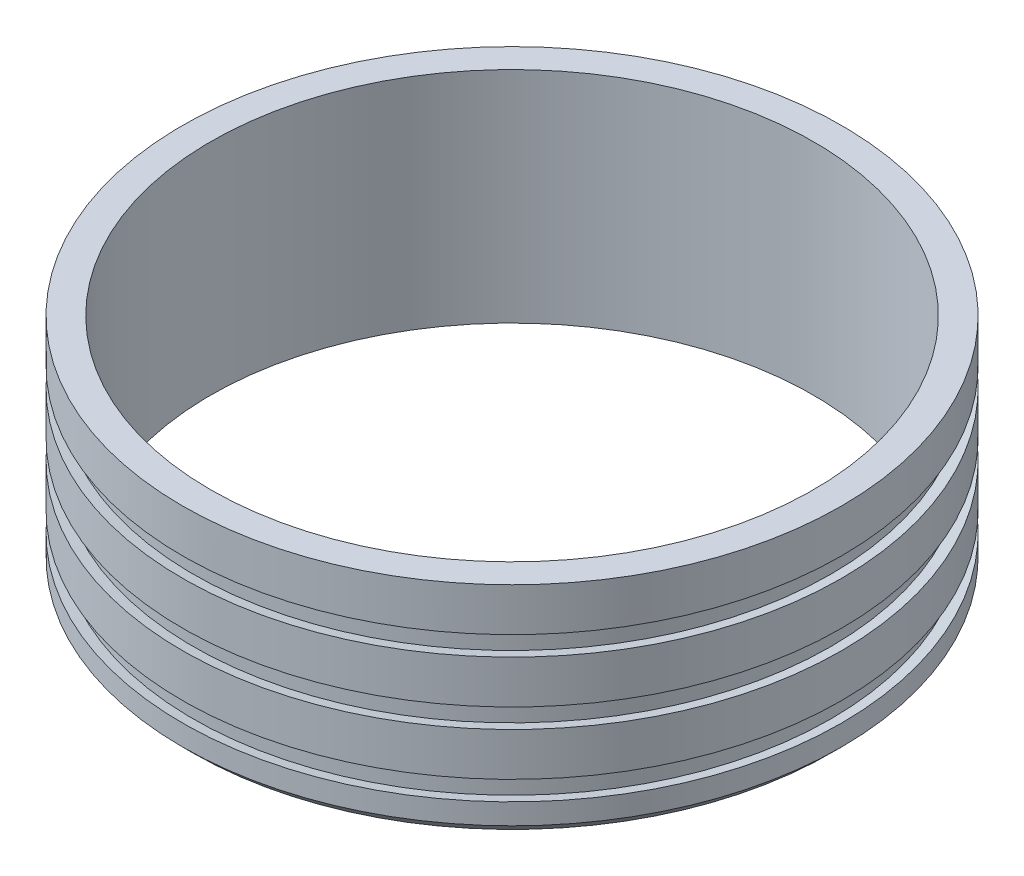
ISO-10303-21;
HEADER;
FILE_DESCRIPTION(('STEP AP214'),'2;1');
FILE_NAME('part.step','',(''),(''),'','','');
FILE_SCHEMA(('AUTOMOTIVE_DESIGN { 1 0 10303 214 1 1 1 1 }'));
ENDSEC;
DATA;
#1=APPLICATION_CONTEXT('core data for automotive mechanical design processes');
#2=APPLICATION_PROTOCOL_DEFINITION('international standard','automotive_design',2000,#1);
#3=PRODUCT_CONTEXT('',#1,'mechanical');
#4=PRODUCT('Part','Part','',(#3));
#5=PRODUCT_RELATED_PRODUCT_CATEGORY('part','',(#4));
#6=PRODUCT_DEFINITION_FORMATION('','',#4);
#7=PRODUCT_DEFINITION_CONTEXT('part definition',#1,'design');
#8=PRODUCT_DEFINITION('design','',#6,#7);
#9=PRODUCT_DEFINITION_SHAPE('','',#8);
#10=(LENGTH_UNIT() NAMED_UNIT(*) SI_UNIT(.MILLI.,.METRE.));
#11=(NAMED_UNIT(*) PLANE_ANGLE_UNIT() SI_UNIT($,.RADIAN.));
#12=(NAMED_UNIT(*) SI_UNIT($,.STERADIAN.) SOLID_ANGLE_UNIT());
#13=UNCERTAINTY_MEASURE_WITH_UNIT(LENGTH_MEASURE(1.E-05),#10,'distance_accuracy_value','');
#14=(GEOMETRIC_REPRESENTATION_CONTEXT(3) GLOBAL_UNCERTAINTY_ASSIGNED_CONTEXT((#13)) GLOBAL_UNIT_ASSIGNED_CONTEXT((#10,
#11,#12)) REPRESENTATION_CONTEXT('',''));
#15=CARTESIAN_POINT('',(0.,0.,0.));
#16=DIRECTION('',(0.,0.,1.));
#17=DIRECTION('',(1.,0.,0.));
#18=AXIS2_PLACEMENT_3D('',#15,#16,#17);
#19=CARTESIAN_POINT('',(0.,50.8,0.));
#20=DIRECTION('',(0.,-1.,0.));
#21=DIRECTION('',(0.,0.,-1.));
#22=AXIS2_PLACEMENT_3D('',#19,#20,#21);
#23=CYLINDRICAL_SURFACE('',#22,76.25);
#24=CARTESIAN_POINT('',(0.,50.8,0.));
#25=DIRECTION('',(0.,1.,0.));
#26=DIRECTION('',(0.,0.,1.));
#27=AXIS2_PLACEMENT_3D('',#24,#25,#26);
#28=CIRCLE('',#27,76.25);
#29=CARTESIAN_POINT('',(0.,50.8,76.25));
#30=VERTEX_POINT('',#29);
#31=EDGE_CURVE('E49',#30,#30,#28,.T.);
#32=ORIENTED_EDGE('',*,*,#31,.F.);
#33=EDGE_LOOP('',(#32));
#34=FACE_BOUND('',#33,.T.);
#35=CARTESIAN_POINT('',(0.,40.8,0.));
#36=DIRECTION('',(0.,-1.,0.));
#37=DIRECTION('',(1.,0.,0.));
#38=AXIS2_PLACEMENT_3D('',#35,#36,#37);
#39=CIRCLE('',#38,76.25);
#40=CARTESIAN_POINT('',(76.25,40.7999999999999,0.));
#41=VERTEX_POINT('',#40);
#42=EDGE_CURVE('E89',#41,#41,#39,.T.);
#43=ORIENTED_EDGE('',*,*,#42,.F.);
#44=EDGE_LOOP('',(#43));
#45=FACE_BOUND('',#44,.T.);
#46=ADVANCED_FACE('F37',(#34,#45),#23,.T.);
#47=CARTESIAN_POINT('',(0.,2.49999999999999,0.));
#48=DIRECTION('',(0.,1.,0.));
#49=DIRECTION('',(0.,0.,1.));
#50=AXIS2_PLACEMENT_3D('',#47,#48,#49);
#51=CIRCLE('',#50,76.25);
#52=CARTESIAN_POINT('',(0.,2.49999999999999,76.25));
#53=VERTEX_POINT('',#52);
#54=EDGE_CURVE('E45',#53,#53,#51,.T.);
#55=ORIENTED_EDGE('',*,*,#54,.T.);
#56=EDGE_LOOP('',(#55));
#57=FACE_BOUND('',#56,.T.);
#58=CARTESIAN_POINT('',(0.,7.29999999999996,0.));
#59=DIRECTION('',(0.,-1.,0.));
#60=DIRECTION('',(1.,0.,0.));
#61=AXIS2_PLACEMENT_3D('',#58,#59,#60);
#62=CIRCLE('',#61,76.2499999999999);
#63=CARTESIAN_POINT('',(76.2499999999999,7.29999999999992,0.));
#64=VERTEX_POINT('',#63);
#65=EDGE_CURVE('E62',#64,#64,#62,.T.);
#66=ORIENTED_EDGE('',*,*,#65,.T.);
#67=EDGE_LOOP('',(#66));
#68=FACE_BOUND('',#67,.T.);
#69=ADVANCED_FACE('F113',(#57,#68),#23,.T.);
#70=CARTESIAN_POINT('',(0.,50.8,0.));
#71=DIRECTION('',(0.,1.,0.));
#72=DIRECTION('',(0.,0.,1.));
#73=AXIS2_PLACEMENT_3D('',#70,#71,#72);
#74=PLANE('',#73);
#75=ORIENTED_EDGE('',*,*,#31,.T.);
#76=EDGE_LOOP('',(#75));
#77=FACE_BOUND('',#76,.T.);
#78=CARTESIAN_POINT('',(0.,50.8,0.));
#79=DIRECTION('',(0.,1.,0.));
#80=DIRECTION('',(0.,0.,1.));
#81=AXIS2_PLACEMENT_3D('',#78,#79,#80);
#82=CIRCLE('',#81,69.75);
#83=CARTESIAN_POINT('',(0.,50.8,69.75));
#84=VERTEX_POINT('',#83);
#85=EDGE_CURVE('E53',#84,#84,#82,.T.);
#86=ORIENTED_EDGE('',*,*,#85,.F.);
#87=EDGE_LOOP('',(#86));
#88=FACE_BOUND('',#87,.T.);
#89=ADVANCED_FACE('F121',(#77,#88),#74,.T.);
#90=CARTESIAN_POINT('',(0.,0.,0.));
#91=DIRECTION('',(0.,1.,0.));
#92=DIRECTION('',(0.,0.,1.));
#93=AXIS2_PLACEMENT_3D('',#90,#91,#92);
#94=PLANE('',#93);
#95=CARTESIAN_POINT('',(0.,0.,0.));
#96=DIRECTION('',(0.,1.,0.));
#97=DIRECTION('',(0.,0.,1.));
#98=AXIS2_PLACEMENT_3D('',#95,#96,#97);
#99=CIRCLE('',#98,73.75);
#100=CARTESIAN_POINT('',(0.,0.,73.75));
#101=VERTEX_POINT('',#100);
#102=EDGE_CURVE('E10',#101,#101,#99,.F.);
#103=ORIENTED_EDGE('',*,*,#102,.T.);
#104=EDGE_LOOP('',(#103));
#105=FACE_BOUND('',#104,.T.);
#106=CARTESIAN_POINT('',(0.,0.,0.));
#107=DIRECTION('',(0.,1.,0.));
#108=DIRECTION('',(0.,0.,1.));
#109=AXIS2_PLACEMENT_3D('',#106,#107,#108);
#110=CIRCLE('',#109,69.75);
#111=CARTESIAN_POINT('',(0.,0.,69.75));
#112=VERTEX_POINT('',#111);
#113=EDGE_CURVE('E56',#112,#112,#110,.T.);
#114=ORIENTED_EDGE('',*,*,#113,.T.);
#115=EDGE_LOOP('',(#114));
#116=FACE_BOUND('',#115,.T.);
#117=ADVANCED_FACE('F164',(#105,#116),#94,.F.);
#118=CARTESIAN_POINT('',(0.,50.8,0.));
#119=DIRECTION('',(0.,-1.,0.));
#120=DIRECTION('',(0.,0.,-1.));
#121=AXIS2_PLACEMENT_3D('',#118,#119,#120);
#122=CYLINDRICAL_SURFACE('',#121,69.75);
#123=ORIENTED_EDGE('',*,*,#85,.T.);
#124=EDGE_LOOP('',(#123));
#125=FACE_BOUND('',#124,.T.);
#126=ORIENTED_EDGE('',*,*,#113,.F.);
#127=EDGE_LOOP('',(#126));
#128=FACE_BOUND('',#127,.T.);
#129=ADVANCED_FACE('F160',(#125,#128),#122,.F.);
#130=CARTESIAN_POINT('',(0.,7.29999999999996,0.));
#131=DIRECTION('',(0.,1.,0.));
#132=DIRECTION('',(-1.,0.,0.));
#133=AXIS2_PLACEMENT_3D('',#130,#131,#132);
#134=CONICAL_SURFACE('',#133,76.2499999999999,1.39626340159546);
#135=CARTESIAN_POINT('',(0.,6.8591825482288,0.));
#136=DIRECTION('',(0.,-1.,0.));
#137=DIRECTION('',(1.,0.,0.));
#138=AXIS2_PLACEMENT_3D('',#135,#136,#137);
#139=CIRCLE('',#138,73.75);
#140=CARTESIAN_POINT('',(73.7499999999999,6.85918254822876,0.));
#141=VERTEX_POINT('',#140);
#142=EDGE_CURVE('E72',#141,#141,#139,.T.);
#143=ORIENTED_EDGE('',*,*,#142,.T.);
#144=EDGE_LOOP('',(#143));
#145=FACE_BOUND('',#144,.T.);
#146=ORIENTED_EDGE('',*,*,#65,.F.);
#147=EDGE_LOOP('',(#146));
#148=FACE_BOUND('',#147,.T.);
#149=ADVANCED_FACE('F156',(#145,#148),#134,.F.);
#150=CARTESIAN_POINT('',(0.,12.2408174517711,0.));
#151=DIRECTION('',(0.,-1.,0.));
#152=DIRECTION('',(1.,0.,0.));
#153=AXIS2_PLACEMENT_3D('',#150,#151,#152);
#154=CONICAL_SURFACE('',#153,73.75,1.39626340159546);
#155=CARTESIAN_POINT('',(0.,11.8,0.));
#156=DIRECTION('',(0.,-1.,0.));
#157=DIRECTION('',(1.,0.,0.));
#158=AXIS2_PLACEMENT_3D('',#155,#156,#157);
#159=CIRCLE('',#158,76.2499999999999);
#160=CARTESIAN_POINT('',(76.2499999999999,11.7999999999999,0.));
#161=VERTEX_POINT('',#160);
#162=EDGE_CURVE('E66',#161,#161,#159,.T.);
#163=ORIENTED_EDGE('',*,*,#162,.T.);
#164=EDGE_LOOP('',(#163));
#165=FACE_BOUND('',#164,.T.);
#166=CARTESIAN_POINT('',(0.,12.2408174517711,0.));
#167=DIRECTION('',(0.,-1.,0.));
#168=DIRECTION('',(1.,0.,0.));
#169=AXIS2_PLACEMENT_3D('',#166,#167,#168);
#170=CIRCLE('',#169,73.75);
#171=CARTESIAN_POINT('',(73.7499999999999,12.2408174517711,0.));
#172=VERTEX_POINT('',#171);
#173=EDGE_CURVE('E69',#172,#172,#170,.T.);
#174=ORIENTED_EDGE('',*,*,#173,.F.);
#175=EDGE_LOOP('',(#174));
#176=FACE_BOUND('',#175,.T.);
#177=ADVANCED_FACE('F143',(#165,#176),#154,.F.);
#178=CARTESIAN_POINT('',(0.,0.,0.));
#179=DIRECTION('',(0.,-1.,0.));
#180=DIRECTION('',(1.,0.,0.));
#181=AXIS2_PLACEMENT_3D('',#178,#179,#180);
#182=CYLINDRICAL_SURFACE('',#181,73.75);
#183=ORIENTED_EDGE('',*,*,#173,.T.);
#184=EDGE_LOOP('',(#183));
#185=FACE_BOUND('',#184,.T.);
#186=ORIENTED_EDGE('',*,*,#142,.F.);
#187=EDGE_LOOP('',(#186));
#188=FACE_BOUND('',#187,.T.);
#189=ADVANCED_FACE('F138',(#185,#188),#182,.T.);
#190=CARTESIAN_POINT('',(0.,36.3,0.));
#191=DIRECTION('',(0.,1.,0.));
#192=DIRECTION('',(-1.,0.,0.));
#193=AXIS2_PLACEMENT_3D('',#190,#191,#192);
#194=CONICAL_SURFACE('',#193,76.25,1.39626340159546);
#195=CARTESIAN_POINT('',(0.,35.8591825482288,0.));
#196=DIRECTION('',(0.,-1.,0.));
#197=DIRECTION('',(1.,0.,0.));
#198=AXIS2_PLACEMENT_3D('',#195,#196,#197);
#199=CIRCLE('',#198,73.75);
#200=CARTESIAN_POINT('',(73.75,35.8591825482288,0.));
#201=VERTEX_POINT('',#200);
#202=EDGE_CURVE('E78',#201,#201,#199,.T.);
#203=ORIENTED_EDGE('',*,*,#202,.T.);
#204=EDGE_LOOP('',(#203));
#205=FACE_BOUND('',#204,.T.);
#206=CARTESIAN_POINT('',(0.,36.3,0.));
#207=DIRECTION('',(0.,-1.,0.));
#208=DIRECTION('',(1.,0.,0.));
#209=AXIS2_PLACEMENT_3D('',#206,#207,#208);
#210=CIRCLE('',#209,76.25);
#211=CARTESIAN_POINT('',(76.2499999999999,36.2999999999999,0.));
#212=VERTEX_POINT('',#211);
#213=EDGE_CURVE('E59',#212,#212,#210,.T.);
#214=ORIENTED_EDGE('',*,*,#213,.F.);
#215=EDGE_LOOP('',(#214));
#216=FACE_BOUND('',#215,.T.);
#217=ADVANCED_FACE('F98',(#205,#216),#194,.F.);
#218=CARTESIAN_POINT('',(0.,41.2408174517711,0.));
#219=DIRECTION('',(0.,-1.,0.));
#220=DIRECTION('',(1.,0.,0.));
#221=AXIS2_PLACEMENT_3D('',#218,#219,#220);
#222=CONICAL_SURFACE('',#221,73.75,1.39626340159546);
#223=ORIENTED_EDGE('',*,*,#42,.T.);
#224=EDGE_LOOP('',(#223));
#225=FACE_BOUND('',#224,.T.);
#226=CARTESIAN_POINT('',(0.,41.2408174517711,0.));
#227=DIRECTION('',(0.,-1.,0.));
#228=DIRECTION('',(1.,0.,0.));
#229=AXIS2_PLACEMENT_3D('',#226,#227,#228);
#230=CIRCLE('',#229,73.75);
#231=CARTESIAN_POINT('',(73.75,41.2408174517711,0.));
#232=VERTEX_POINT('',#231);
#233=EDGE_CURVE('E92',#232,#232,#230,.T.);
#234=ORIENTED_EDGE('',*,*,#233,.F.);
#235=EDGE_LOOP('',(#234));
#236=FACE_BOUND('',#235,.T.);
#237=ADVANCED_FACE('F104',(#225,#236),#222,.F.);
#238=CARTESIAN_POINT('',(0.,0.,0.));
#239=DIRECTION('',(0.,-1.,0.));
#240=DIRECTION('',(1.,0.,0.));
#241=AXIS2_PLACEMENT_3D('',#238,#239,#240);
#242=CYLINDRICAL_SURFACE('',#241,73.75);
#243=ORIENTED_EDGE('',*,*,#233,.T.);
#244=EDGE_LOOP('',(#243));
#245=FACE_BOUND('',#244,.T.);
#246=ORIENTED_EDGE('',*,*,#202,.F.);
#247=EDGE_LOOP('',(#246));
#248=FACE_BOUND('',#247,.T.);
#249=ADVANCED_FACE('F101',(#245,#248),#242,.T.);
#250=ORIENTED_EDGE('',*,*,#162,.F.);
#251=EDGE_LOOP('',(#250));
#252=FACE_BOUND('',#251,.T.);
#253=CARTESIAN_POINT('',(0.,21.8,0.));
#254=DIRECTION('',(0.,-1.,0.));
#255=DIRECTION('',(1.,0.,0.));
#256=AXIS2_PLACEMENT_3D('',#253,#254,#255);
#257=CIRCLE('',#256,76.25);
#258=CARTESIAN_POINT('',(76.2499999999999,21.7999999999999,0.));
#259=VERTEX_POINT('',#258);
#260=EDGE_CURVE('E75',#259,#259,#257,.T.);
#261=ORIENTED_EDGE('',*,*,#260,.T.);
#262=EDGE_LOOP('',(#261));
#263=FACE_BOUND('',#262,.T.);
#264=ADVANCED_FACE('F103',(#252,#263),#23,.T.);
#265=CARTESIAN_POINT('',(0.,26.3,0.));
#266=DIRECTION('',(0.,-1.,0.));
#267=DIRECTION('',(1.,0.,0.));
#268=AXIS2_PLACEMENT_3D('',#265,#266,#267);
#269=CIRCLE('',#268,76.25);
#270=CARTESIAN_POINT('',(76.2499999999999,26.2999999999999,0.));
#271=VERTEX_POINT('',#270);
#272=EDGE_CURVE('E79',#271,#271,#269,.T.);
#273=ORIENTED_EDGE('',*,*,#272,.F.);
#274=EDGE_LOOP('',(#273));
#275=FACE_BOUND('',#274,.T.);
#276=ORIENTED_EDGE('',*,*,#213,.T.);
#277=EDGE_LOOP('',(#276));
#278=FACE_BOUND('',#277,.T.);
#279=ADVANCED_FACE('F111',(#275,#278),#23,.T.);
#280=CARTESIAN_POINT('',(0.,21.8,0.));
#281=DIRECTION('',(0.,1.,0.));
#282=DIRECTION('',(-1.,0.,0.));
#283=AXIS2_PLACEMENT_3D('',#280,#281,#282);
#284=CONICAL_SURFACE('',#283,76.25,1.39626340159546);
#285=CARTESIAN_POINT('',(0.,21.3591825482288,0.));
#286=DIRECTION('',(0.,-1.,0.));
#287=DIRECTION('',(1.,0.,0.));
#288=AXIS2_PLACEMENT_3D('',#285,#286,#287);
#289=CIRCLE('',#288,73.75);
#290=CARTESIAN_POINT('',(73.75,21.3591825482288,0.));
#291=VERTEX_POINT('',#290);
#292=EDGE_CURVE('E65',#291,#291,#289,.T.);
#293=ORIENTED_EDGE('',*,*,#292,.T.);
#294=EDGE_LOOP('',(#293));
#295=FACE_BOUND('',#294,.T.);
#296=ORIENTED_EDGE('',*,*,#260,.F.);
#297=EDGE_LOOP('',(#296));
#298=FACE_BOUND('',#297,.T.);
#299=ADVANCED_FACE('F126',(#295,#298),#284,.F.);
#300=CARTESIAN_POINT('',(0.,26.7408174517711,0.));
#301=DIRECTION('',(0.,-1.,0.));
#302=DIRECTION('',(1.,0.,0.));
#303=AXIS2_PLACEMENT_3D('',#300,#301,#302);
#304=CONICAL_SURFACE('',#303,73.75,1.39626340159546);
#305=ORIENTED_EDGE('',*,*,#272,.T.);
#306=EDGE_LOOP('',(#305));
#307=FACE_BOUND('',#306,.T.);
#308=CARTESIAN_POINT('',(0.,26.7408174517711,0.));
#309=DIRECTION('',(0.,-1.,0.));
#310=DIRECTION('',(1.,0.,0.));
#311=AXIS2_PLACEMENT_3D('',#308,#309,#310);
#312=CIRCLE('',#311,73.75);
#313=CARTESIAN_POINT('',(73.75,26.7408174517711,0.));
#314=VERTEX_POINT('',#313);
#315=EDGE_CURVE('E82',#314,#314,#312,.T.);
#316=ORIENTED_EDGE('',*,*,#315,.F.);
#317=EDGE_LOOP('',(#316));
#318=FACE_BOUND('',#317,.T.);
#319=ADVANCED_FACE('F131',(#307,#318),#304,.F.);
#320=CARTESIAN_POINT('',(0.,0.,0.));
#321=DIRECTION('',(0.,-1.,0.));
#322=DIRECTION('',(1.,0.,0.));
#323=AXIS2_PLACEMENT_3D('',#320,#321,#322);
#324=CYLINDRICAL_SURFACE('',#323,73.75);
#325=ORIENTED_EDGE('',*,*,#315,.T.);
#326=EDGE_LOOP('',(#325));
#327=FACE_BOUND('',#326,.T.);
#328=ORIENTED_EDGE('',*,*,#292,.F.);
#329=EDGE_LOOP('',(#328));
#330=FACE_BOUND('',#329,.T.);
#331=ADVANCED_FACE('F147',(#327,#330),#324,.T.);
#332=CARTESIAN_POINT('',(0.,2.49999999999999,0.));
#333=DIRECTION('',(0.,1.,0.));
#334=DIRECTION('',(0.,0.,1.));
#335=AXIS2_PLACEMENT_3D('',#332,#333,#334);
#336=CONICAL_SURFACE('',#335,76.25,0.785398163397451);
#337=ORIENTED_EDGE('',*,*,#102,.F.);
#338=EDGE_LOOP('',(#337));
#339=FACE_BOUND('',#338,.T.);
#340=ORIENTED_EDGE('',*,*,#54,.F.);
#341=EDGE_LOOP('',(#340));
#342=FACE_BOUND('',#341,.T.);
#343=ADVANCED_FACE('F40',(#339,#342),#336,.T.);
#344=CLOSED_SHELL('',(#46,#69,#89,#117,#129,#149,#177,#189,#217,#237,#249,#264,#279,#299,#319,
#331,#343));
#345=MANIFOLD_SOLID_BREP('B2',#344);
#346=ADVANCED_BREP_SHAPE_REPRESENTATION('',(#18,#345),#14);
#347=SHAPE_DEFINITION_REPRESENTATION(#9,#346);
ENDSEC;
END-ISO-10303-21;
